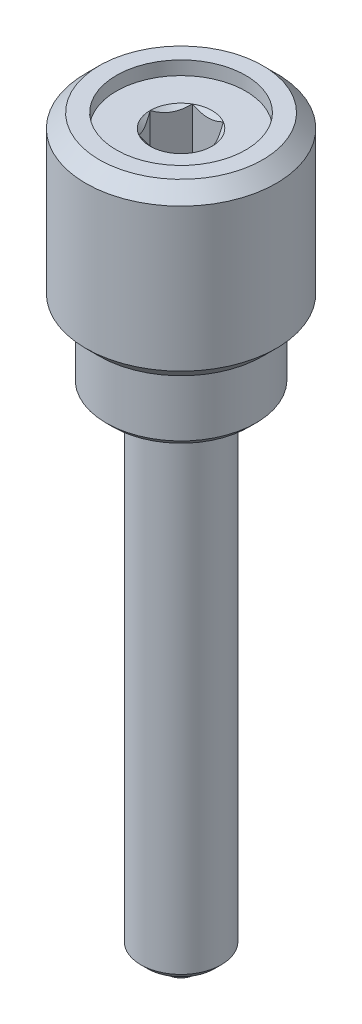
ISO-10303-21;
HEADER;
FILE_DESCRIPTION(('STEP AP214'),'2;1');
FILE_NAME('part.step','',(''),(''),'','','');
FILE_SCHEMA(('AUTOMOTIVE_DESIGN { 1 0 10303 214 1 1 1 1 }'));
ENDSEC;
DATA;
#1=APPLICATION_CONTEXT('core data for automotive mechanical design processes');
#2=APPLICATION_PROTOCOL_DEFINITION('international standard','automotive_design',2000,#1);
#3=PRODUCT_CONTEXT('',#1,'mechanical');
#4=PRODUCT('Part','Part','',(#3));
#5=PRODUCT_RELATED_PRODUCT_CATEGORY('part','',(#4));
#6=PRODUCT_DEFINITION_FORMATION('','',#4);
#7=PRODUCT_DEFINITION_CONTEXT('part definition',#1,'design');
#8=PRODUCT_DEFINITION('design','',#6,#7);
#9=PRODUCT_DEFINITION_SHAPE('','',#8);
#10=(LENGTH_UNIT() NAMED_UNIT(*) SI_UNIT(.MILLI.,.METRE.));
#11=(NAMED_UNIT(*) PLANE_ANGLE_UNIT() SI_UNIT($,.RADIAN.));
#12=(NAMED_UNIT(*) SI_UNIT($,.STERADIAN.) SOLID_ANGLE_UNIT());
#13=UNCERTAINTY_MEASURE_WITH_UNIT(LENGTH_MEASURE(1.E-05),#10,'distance_accuracy_value','');
#14=(GEOMETRIC_REPRESENTATION_CONTEXT(3) GLOBAL_UNCERTAINTY_ASSIGNED_CONTEXT((#13)) GLOBAL_UNIT_ASSIGNED_CONTEXT((#10,
#11,#12)) REPRESENTATION_CONTEXT('',''));
#15=CARTESIAN_POINT('',(0.,0.,0.));
#16=DIRECTION('',(0.,0.,1.));
#17=DIRECTION('',(1.,0.,0.));
#18=AXIS2_PLACEMENT_3D('',#15,#16,#17);
#19=CARTESIAN_POINT('',(-32.4595739108986,28.4606144962938,-1.77583706374662));
#20=DIRECTION('',(0.,1.,0.));
#21=DIRECTION('',(-0.634151036933604,0.,0.77320919701982));
#22=AXIS2_PLACEMENT_3D('',#19,#20,#21);
#23=PLANE('',#22);
#24=CARTESIAN_POINT('',(-32.4595739108986,28.4606144962938,-1.77583706374662));
#25=DIRECTION('',(0.,-1.,0.));
#26=DIRECTION('',(0.634151036933604,0.,-0.77320919701982));
#27=AXIS2_PLACEMENT_3D('',#24,#25,#26);
#28=CIRCLE('',#27,1.246);
#29=CARTESIAN_POINT('',(-31.6694217188793,28.4606144962938,-2.73925572323332));
#30=VERTEX_POINT('',#29);
#31=EDGE_CURVE('P0_E11',#30,#30,#28,.T.);
#32=ORIENTED_EDGE('',*,*,#31,.F.);
#33=EDGE_LOOP('',(#32));
#34=FACE_BOUND('',#33,.T.);
#35=ADVANCED_FACE('P0_F17',(#34),#23,.T.);
#36=CARTESIAN_POINT('',(-32.4595739108986,28.2066144962938,-1.77583706374662));
#37=DIRECTION('',(0.,-1.,0.));
#38=DIRECTION('',(0.634151036933604,0.,-0.77320919701982));
#39=AXIS2_PLACEMENT_3D('',#36,#37,#38);
#40=CONICAL_SURFACE('',#39,1.5,0.785398163397446);
#41=ORIENTED_EDGE('',*,*,#31,.T.);
#42=EDGE_LOOP('',(#41));
#43=FACE_BOUND('',#42,.T.);
#44=CARTESIAN_POINT('',(-32.4595739108986,28.2066144962938,-1.77583706374662));
#45=DIRECTION('',(0.,-1.,0.));
#46=DIRECTION('',(0.634151036933604,0.,-0.77320919701982));
#47=AXIS2_PLACEMENT_3D('',#44,#45,#46);
#48=CIRCLE('',#47,1.5);
#49=CARTESIAN_POINT('',(-31.5083473554982,28.2066144962938,-2.93565085927635));
#50=VERTEX_POINT('',#49);
#51=EDGE_CURVE('P0_E23',#50,#50,#48,.T.);
#52=ORIENTED_EDGE('',*,*,#51,.F.);
#53=EDGE_LOOP('',(#52));
#54=FACE_BOUND('',#53,.T.);
#55=ADVANCED_FACE('P0_F40',(#43,#54),#40,.T.);
#56=CARTESIAN_POINT('',(-32.4595739108986,6.39222676754855,-1.77583706374662));
#57=DIRECTION('',(0.,-1.,0.));
#58=DIRECTION('',(0.634151036933604,0.,-0.77320919701982));
#59=AXIS2_PLACEMENT_3D('',#56,#57,#58);
#60=CYLINDRICAL_SURFACE('',#59,1.5);
#61=ORIENTED_EDGE('',*,*,#51,.T.);
#62=EDGE_LOOP('',(#61));
#63=FACE_BOUND('',#62,.T.);
#64=CARTESIAN_POINT('',(-32.4595739108986,5.47661449629384,-1.77583706374662));
#65=DIRECTION('',(0.,-1.,0.));
#66=DIRECTION('',(0.634151036933604,0.,-0.77320919701982));
#67=AXIS2_PLACEMENT_3D('',#64,#65,#66);
#68=CIRCLE('',#67,1.5);
#69=CARTESIAN_POINT('',(-31.5083473554982,5.47661449629384,-2.93565085927635));
#70=VERTEX_POINT('',#69);
#71=EDGE_CURVE('P0_E52',#70,#70,#68,.T.);
#72=ORIENTED_EDGE('',*,*,#71,.F.);
#73=EDGE_LOOP('',(#72));
#74=FACE_BOUND('',#73,.T.);
#75=ADVANCED_FACE('P0_F45',(#63,#74),#60,.T.);
#76=CARTESIAN_POINT('',(-32.4595739108986,5.22261449629384,-1.77583706374662));
#77=DIRECTION('',(0.,1.,0.));
#78=DIRECTION('',(-0.634151036933604,0.,0.77320919701982));
#79=AXIS2_PLACEMENT_3D('',#76,#77,#78);
#80=CONICAL_SURFACE('',#79,1.246,0.785398163397447);
#81=ORIENTED_EDGE('',*,*,#71,.T.);
#82=EDGE_LOOP('',(#81));
#83=FACE_BOUND('',#82,.T.);
#84=CARTESIAN_POINT('',(-32.4595739108986,5.22261449629384,-1.77583706374662));
#85=DIRECTION('',(0.,-1.,0.));
#86=DIRECTION('',(0.634151036933604,0.,-0.77320919701982));
#87=AXIS2_PLACEMENT_3D('',#84,#85,#86);
#88=CIRCLE('',#87,1.246);
#89=CARTESIAN_POINT('',(-31.6694217188793,5.22261449629384,-2.73925572323332));
#90=VERTEX_POINT('',#89);
#91=EDGE_CURVE('P0_E54',#90,#90,#88,.T.);
#92=ORIENTED_EDGE('',*,*,#91,.F.);
#93=EDGE_LOOP('',(#92));
#94=FACE_BOUND('',#93,.T.);
#95=ADVANCED_FACE('P0_F68',(#83,#94),#80,.T.);
#96=CARTESIAN_POINT('',(-31.952189666248,5.22261449629384,-2.39448174228218));
#97=DIRECTION('',(0.,-1.,0.));
#98=DIRECTION('',(0.634151036933604,0.,-0.77320919701982));
#99=AXIS2_PLACEMENT_3D('',#96,#97,#98);
#100=PLANE('',#99);
#101=ORIENTED_EDGE('',*,*,#91,.T.);
#102=EDGE_LOOP('',(#101));
#103=FACE_BOUND('',#102,.T.);
#104=CARTESIAN_POINT('',(-32.4595739108986,5.22261449629384,-1.77583706374662));
#105=DIRECTION('',(0.,-1.,0.));
#106=DIRECTION('',(0.634151036933604,0.,-0.77320919701982));
#107=AXIS2_PLACEMENT_3D('',#104,#105,#106);
#108=CIRCLE('',#107,0.8001);
#109=CARTESIAN_POINT('',(-31.952189666248,5.22261449629384,-2.39448174228218));
#110=VERTEX_POINT('',#109);
#111=EDGE_CURVE('P0_E59',#110,#110,#108,.T.);
#112=ORIENTED_EDGE('',*,*,#111,.F.);
#113=EDGE_LOOP('',(#112));
#114=FACE_BOUND('',#113,.T.);
#115=ADVANCED_FACE('P0_F35',(#103,#114),#100,.T.);
#116=CARTESIAN_POINT('',(-32.4595739108986,6.39222676754855,-1.77583706374662));
#117=DIRECTION('',(0.,-1.,0.));
#118=DIRECTION('',(0.634151036933604,0.,-0.77320919701982));
#119=AXIS2_PLACEMENT_3D('',#116,#117,#118);
#120=CYLINDRICAL_SURFACE('',#119,0.8001);
#121=ORIENTED_EDGE('',*,*,#111,.T.);
#122=EDGE_LOOP('',(#121));
#123=FACE_BOUND('',#122,.T.);
#124=CARTESIAN_POINT('',(-32.4595739108986,5.59212676754855,-1.77583706374662));
#125=DIRECTION('',(0.,-1.,0.));
#126=DIRECTION('',(0.634151036933604,0.,-0.77320919701982));
#127=AXIS2_PLACEMENT_3D('',#124,#125,#126);
#128=CIRCLE('',#127,0.8001);
#129=CARTESIAN_POINT('',(-31.952189666248,5.59212676754855,-2.39448174228218));
#130=VERTEX_POINT('',#129);
#131=EDGE_CURVE('P0_E62',#130,#130,#128,.T.);
#132=ORIENTED_EDGE('',*,*,#131,.F.);
#133=EDGE_LOOP('',(#132));
#134=FACE_BOUND('',#133,.T.);
#135=ADVANCED_FACE('P0_F28',(#123,#134),#120,.F.);
#136=CARTESIAN_POINT('',(-32.4595739108986,6.39222676754855,-1.77583706374662));
#137=DIRECTION('',(0.,-1.,0.));
#138=DIRECTION('',(0.634151036933604,0.,-0.77320919701982));
#139=AXIS2_PLACEMENT_3D('',#136,#137,#138);
#140=CONICAL_SURFACE('',#139,0.,0.785398163397448);
#141=ORIENTED_EDGE('',*,*,#131,.T.);
#142=EDGE_LOOP('',(#141));
#143=FACE_BOUND('',#142,.T.);
#144=CARTESIAN_POINT('',(-32.4595739108986,6.39222676754855,-1.77583706374662));
#145=VERTEX_POINT('',#144);
#146=VERTEX_LOOP('',#145);
#147=FACE_BOUND('',#146,.T.);
#148=ADVANCED_FACE('P0_F26',(#143,#147),#140,.F.);
#149=CLOSED_SHELL('',(#35,#55,#75,#95,#115,#135,#148));
#150=MANIFOLD_SOLID_BREP('P0_B1',#149);
#151=CARTESIAN_POINT('',(-38.2704597873602,31.7626144962938,-1.77583706374662));
#152=DIRECTION('',(0.,1.,0.));
#153=DIRECTION('',(0.,0.,1.));
#154=AXIS2_PLACEMENT_3D('',#151,#152,#153);
#155=PLANE('',#154);
#156=CARTESIAN_POINT('',(-32.4595739108986,31.7626144962938,-1.77583706374662));
#157=DIRECTION('',(0.,1.,0.));
#158=DIRECTION('',(0.,0.,1.));
#159=AXIS2_PLACEMENT_3D('',#156,#157,#158);
#160=CIRCLE('',#159,2.413);
#161=CARTESIAN_POINT('',(-32.4595739108986,31.7626144962938,0.637162936253378));
#162=VERTEX_POINT('',#161);
#163=EDGE_CURVE('P1_E29',#162,#162,#160,.T.);
#164=ORIENTED_EDGE('',*,*,#163,.T.);
#165=EDGE_LOOP('',(#164));
#166=FACE_BOUND('',#165,.T.);
#167=CARTESIAN_POINT('',(-32.4595739108986,31.7626144962938,-1.77583706374662));
#168=DIRECTION('',(0.,1.,0.));
#169=DIRECTION('',(-1.,0.,0.));
#170=AXIS2_PLACEMENT_3D('',#167,#168,#169);
#171=CIRCLE('',#170,1.15470053837925);
#172=CARTESIAN_POINT('',(-33.0369241800882,31.7626144962938,-0.77583706374662));
#173=VERTEX_POINT('',#172);
#174=CARTESIAN_POINT('',(-31.882223641709,31.7626144962938,-0.77583706374662));
#175=VERTEX_POINT('',#174);
#176=EDGE_CURVE('P1_E42',#173,#175,#171,.T.);
#177=ORIENTED_EDGE('',*,*,#176,.F.);
#178=CARTESIAN_POINT('',(-33.6142744492779,31.7626144962938,-1.77583706374662));
#179=VERTEX_POINT('',#178);
#180=EDGE_CURVE('P1_E110',#179,#173,#171,.T.);
#181=ORIENTED_EDGE('',*,*,#180,.F.);
#182=CARTESIAN_POINT('',(-33.0369241800882,31.7626144962938,-2.77583706374662));
#183=VERTEX_POINT('',#182);
#184=EDGE_CURVE('P1_E109',#183,#179,#171,.T.);
#185=ORIENTED_EDGE('',*,*,#184,.F.);
#186=CARTESIAN_POINT('',(-31.882223641709,31.7626144962938,-2.77583706374662));
#187=VERTEX_POINT('',#186);
#188=EDGE_CURVE('P1_E81',#187,#183,#171,.T.);
#189=ORIENTED_EDGE('',*,*,#188,.F.);
#190=CARTESIAN_POINT('',(-31.3048733725193,31.7626144962938,-1.77583706374662));
#191=VERTEX_POINT('',#190);
#192=EDGE_CURVE('P1_E74',#191,#187,#171,.T.);
#193=ORIENTED_EDGE('',*,*,#192,.F.);
#194=EDGE_CURVE('P1_E35',#175,#191,#171,.T.);
#195=ORIENTED_EDGE('',*,*,#194,.F.);
#196=EDGE_LOOP('',(#177,#181,#185,#189,#193,#195));
#197=FACE_BOUND('',#196,.T.);
#198=ADVANCED_FACE('P1_F17',(#166,#197),#155,.T.);
#199=CARTESIAN_POINT('',(-32.4595739108986,32.2706144962938,-1.77583706374662));
#200=DIRECTION('',(0.,1.,0.));
#201=DIRECTION('',(0.,0.,1.));
#202=AXIS2_PLACEMENT_3D('',#199,#200,#201);
#203=CYLINDRICAL_SURFACE('',#202,2.413);
#204=CARTESIAN_POINT('',(-32.4595739108986,32.2706144962938,-1.77583706374662));
#205=DIRECTION('',(0.,1.,0.));
#206=DIRECTION('',(0.,0.,1.));
#207=AXIS2_PLACEMENT_3D('',#204,#205,#206);
#208=CIRCLE('',#207,2.413);
#209=CARTESIAN_POINT('',(-32.4595739108986,32.2706144962938,0.637162936253378));
#210=VERTEX_POINT('',#209);
#211=EDGE_CURVE('P1_E181',#210,#210,#208,.T.);
#212=ORIENTED_EDGE('',*,*,#211,.T.);
#213=EDGE_LOOP('',(#212));
#214=FACE_BOUND('',#213,.T.);
#215=ORIENTED_EDGE('',*,*,#163,.F.);
#216=EDGE_LOOP('',(#215));
#217=FACE_BOUND('',#216,.T.);
#218=ADVANCED_FACE('P1_F171',(#214,#217),#203,.F.);
#219=CARTESIAN_POINT('',(-38.2704597873602,32.2706144962938,-1.77583706374662));
#220=DIRECTION('',(0.,1.,0.));
#221=DIRECTION('',(0.,0.,1.));
#222=AXIS2_PLACEMENT_3D('',#219,#220,#221);
#223=PLANE('',#222);
#224=CARTESIAN_POINT('',(-32.4595739108986,32.2706144962938,-1.77583706374662));
#225=DIRECTION('',(0.,1.,0.));
#226=DIRECTION('',(0.,0.,1.));
#227=AXIS2_PLACEMENT_3D('',#224,#225,#226);
#228=CIRCLE('',#227,3.048);
#229=CARTESIAN_POINT('',(-32.4595739108986,32.2706144962938,1.27216293625338));
#230=VERTEX_POINT('',#229);
#231=EDGE_CURVE('P1_E183',#230,#230,#228,.T.);
#232=ORIENTED_EDGE('',*,*,#231,.T.);
#233=EDGE_LOOP('',(#232));
#234=FACE_BOUND('',#233,.T.);
#235=ORIENTED_EDGE('',*,*,#211,.F.);
#236=EDGE_LOOP('',(#235));
#237=FACE_BOUND('',#236,.T.);
#238=ADVANCED_FACE('P1_F176',(#234,#237),#223,.T.);
#239=CARTESIAN_POINT('',(-32.4595739108986,32.2706144962938,-1.77583706374662));
#240=DIRECTION('',(0.,-1.,0.));
#241=DIRECTION('',(0.,0.,-1.));
#242=AXIS2_PLACEMENT_3D('',#239,#240,#241);
#243=CONICAL_SURFACE('',#242,3.048,0.78539816339745);
#244=CARTESIAN_POINT('',(-32.4595739108986,31.7626144962938,-1.77583706374662));
#245=DIRECTION('',(0.,1.,0.));
#246=DIRECTION('',(0.,0.,1.));
#247=AXIS2_PLACEMENT_3D('',#244,#245,#246);
#248=CIRCLE('',#247,3.556);
#249=CARTESIAN_POINT('',(-32.4595739108986,31.7626144962938,1.78016293625338));
#250=VERTEX_POINT('',#249);
#251=EDGE_CURVE('P1_E188',#250,#250,#248,.T.);
#252=ORIENTED_EDGE('',*,*,#251,.T.);
#253=EDGE_LOOP('',(#252));
#254=FACE_BOUND('',#253,.T.);
#255=ORIENTED_EDGE('',*,*,#231,.F.);
#256=EDGE_LOOP('',(#255));
#257=FACE_BOUND('',#256,.T.);
#258=ADVANCED_FACE('P1_F297',(#254,#257),#243,.T.);
#259=CARTESIAN_POINT('',(-32.4595739108986,32.2706144962938,-1.77583706374662));
#260=DIRECTION('',(0.,1.,0.));
#261=DIRECTION('',(0.,0.,1.));
#262=AXIS2_PLACEMENT_3D('',#259,#260,#261);
#263=CYLINDRICAL_SURFACE('',#262,3.556);
#264=CARTESIAN_POINT('',(-32.4595739108986,26.4286144962938,-1.77583706374662));
#265=DIRECTION('',(0.,1.,0.));
#266=DIRECTION('',(0.,0.,1.));
#267=AXIS2_PLACEMENT_3D('',#264,#265,#266);
#268=CIRCLE('',#267,3.556);
#269=CARTESIAN_POINT('',(-32.4595739108986,26.4286144962938,1.78016293625338));
#270=VERTEX_POINT('',#269);
#271=EDGE_CURVE('P1_E191',#270,#270,#268,.T.);
#272=ORIENTED_EDGE('',*,*,#271,.T.);
#273=EDGE_LOOP('',(#272));
#274=FACE_BOUND('',#273,.T.);
#275=ORIENTED_EDGE('',*,*,#251,.F.);
#276=EDGE_LOOP('',(#275));
#277=FACE_BOUND('',#276,.T.);
#278=ADVANCED_FACE('P1_F293',(#274,#277),#263,.T.);
#279=CARTESIAN_POINT('',(-32.4595739108986,26.4286144962938,-1.77583706374662));
#280=DIRECTION('',(0.,1.,0.));
#281=DIRECTION('',(0.,0.,1.));
#282=AXIS2_PLACEMENT_3D('',#279,#280,#281);
#283=CONICAL_SURFACE('',#282,3.556,0.78539816339745);
#284=CARTESIAN_POINT('',(-32.4595739108986,25.9206144962938,-1.77583706374662));
#285=DIRECTION('',(0.,1.,0.));
#286=DIRECTION('',(0.,0.,1.));
#287=AXIS2_PLACEMENT_3D('',#284,#285,#286);
#288=CIRCLE('',#287,3.048);
#289=CARTESIAN_POINT('',(-32.4595739108986,25.9206144962938,1.27216293625338));
#290=VERTEX_POINT('',#289);
#291=EDGE_CURVE('P1_E194',#290,#290,#288,.T.);
#292=ORIENTED_EDGE('',*,*,#291,.T.);
#293=EDGE_LOOP('',(#292));
#294=FACE_BOUND('',#293,.T.);
#295=ORIENTED_EDGE('',*,*,#271,.F.);
#296=EDGE_LOOP('',(#295));
#297=FACE_BOUND('',#296,.T.);
#298=ADVANCED_FACE('P1_F289',(#294,#297),#283,.T.);
#299=CARTESIAN_POINT('',(-38.2704597873602,25.9206144962938,-1.77583706374662));
#300=DIRECTION('',(0.,-1.,0.));
#301=DIRECTION('',(0.,0.,-1.));
#302=AXIS2_PLACEMENT_3D('',#299,#300,#301);
#303=PLANE('',#302);
#304=CARTESIAN_POINT('',(-32.4595739108986,25.9206144962938,-1.77583706374662));
#305=DIRECTION('',(0.,1.,0.));
#306=DIRECTION('',(0.,0.,1.));
#307=AXIS2_PLACEMENT_3D('',#304,#305,#306);
#308=CIRCLE('',#307,2.794);
#309=CARTESIAN_POINT('',(-32.4595739108986,25.9206144962938,1.01816293625338));
#310=VERTEX_POINT('',#309);
#311=EDGE_CURVE('P1_E197',#310,#310,#308,.T.);
#312=ORIENTED_EDGE('',*,*,#311,.T.);
#313=EDGE_LOOP('',(#312));
#314=FACE_BOUND('',#313,.T.);
#315=ORIENTED_EDGE('',*,*,#291,.F.);
#316=EDGE_LOOP('',(#315));
#317=FACE_BOUND('',#316,.T.);
#318=ADVANCED_FACE('P1_F285',(#314,#317),#303,.T.);
#319=CARTESIAN_POINT('',(-32.4595739108986,32.2706144962938,-1.77583706374662));
#320=DIRECTION('',(0.,1.,0.));
#321=DIRECTION('',(0.,0.,1.));
#322=AXIS2_PLACEMENT_3D('',#319,#320,#321);
#323=CYLINDRICAL_SURFACE('',#322,2.794);
#324=CARTESIAN_POINT('',(-32.4595739108986,23.6346144962938,-1.77583706374662));
#325=DIRECTION('',(0.,1.,0.));
#326=DIRECTION('',(0.,0.,1.));
#327=AXIS2_PLACEMENT_3D('',#324,#325,#326);
#328=CIRCLE('',#327,2.794);
#329=CARTESIAN_POINT('',(-32.4595739108986,23.6346144962938,1.01816293625338));
#330=VERTEX_POINT('',#329);
#331=EDGE_CURVE('P1_E200',#330,#330,#328,.T.);
#332=ORIENTED_EDGE('',*,*,#331,.T.);
#333=EDGE_LOOP('',(#332));
#334=FACE_BOUND('',#333,.T.);
#335=ORIENTED_EDGE('',*,*,#311,.F.);
#336=EDGE_LOOP('',(#335));
#337=FACE_BOUND('',#336,.T.);
#338=ADVANCED_FACE('P1_F281',(#334,#337),#323,.T.);
#339=CARTESIAN_POINT('',(-32.4595739108986,23.6346144962938,-1.77583706374662));
#340=DIRECTION('',(0.,1.,0.));
#341=DIRECTION('',(0.,0.,1.));
#342=AXIS2_PLACEMENT_3D('',#339,#340,#341);
#343=CONICAL_SURFACE('',#342,2.794,0.785398163397447);
#344=CARTESIAN_POINT('',(-32.4595739108986,23.3806144962938,-1.77583706374662));
#345=DIRECTION('',(0.,1.,0.));
#346=DIRECTION('',(0.,0.,1.));
#347=AXIS2_PLACEMENT_3D('',#344,#345,#346);
#348=CIRCLE('',#347,2.54);
#349=CARTESIAN_POINT('',(-32.4595739108986,23.3806144962938,0.76416293625338));
#350=VERTEX_POINT('',#349);
#351=EDGE_CURVE('P1_E203',#350,#350,#348,.T.);
#352=ORIENTED_EDGE('',*,*,#351,.T.);
#353=EDGE_LOOP('',(#352));
#354=FACE_BOUND('',#353,.T.);
#355=ORIENTED_EDGE('',*,*,#331,.F.);
#356=EDGE_LOOP('',(#355));
#357=FACE_BOUND('',#356,.T.);
#358=ADVANCED_FACE('P1_F277',(#354,#357),#343,.T.);
#359=CARTESIAN_POINT('',(-38.2704597873602,23.3806144962938,-1.77583706374662));
#360=DIRECTION('',(0.,-1.,0.));
#361=DIRECTION('',(0.,0.,-1.));
#362=AXIS2_PLACEMENT_3D('',#359,#360,#361);
#363=PLANE('',#362);
#364=CARTESIAN_POINT('',(-32.4595739108986,23.3806144962938,-1.77583706374662));
#365=DIRECTION('',(0.,1.,0.));
#366=DIRECTION('',(0.,0.,1.));
#367=AXIS2_PLACEMENT_3D('',#364,#365,#366);
#368=CIRCLE('',#367,1.754);
#369=CARTESIAN_POINT('',(-32.4595739108986,23.3806144962938,-0.0218370637466213));
#370=VERTEX_POINT('',#369);
#371=EDGE_CURVE('P1_E206',#370,#370,#368,.T.);
#372=ORIENTED_EDGE('',*,*,#371,.T.);
#373=EDGE_LOOP('',(#372));
#374=FACE_BOUND('',#373,.T.);
#375=ORIENTED_EDGE('',*,*,#351,.F.);
#376=EDGE_LOOP('',(#375));
#377=FACE_BOUND('',#376,.T.);
#378=ADVANCED_FACE('P1_F273',(#374,#377),#363,.T.);
#379=CARTESIAN_POINT('',(-32.4595739108986,23.3806144962938,-1.77583706374662));
#380=DIRECTION('',(0.,-1.,0.));
#381=DIRECTION('',(0.,0.,-1.));
#382=AXIS2_PLACEMENT_3D('',#379,#380,#381);
#383=CONICAL_SURFACE('',#382,1.754,0.785398163397448);
#384=CARTESIAN_POINT('',(-32.4595739108986,23.6346144962938,-1.77583706374662));
#385=DIRECTION('',(0.,1.,0.));
#386=DIRECTION('',(0.,0.,1.));
#387=AXIS2_PLACEMENT_3D('',#384,#385,#386);
#388=CIRCLE('',#387,1.5);
#389=CARTESIAN_POINT('',(-32.4595739108986,23.6346144962938,-0.27583706374662));
#390=VERTEX_POINT('',#389);
#391=EDGE_CURVE('P1_E209',#390,#390,#388,.T.);
#392=ORIENTED_EDGE('',*,*,#391,.T.);
#393=EDGE_LOOP('',(#392));
#394=FACE_BOUND('',#393,.T.);
#395=ORIENTED_EDGE('',*,*,#371,.F.);
#396=EDGE_LOOP('',(#395));
#397=FACE_BOUND('',#396,.T.);
#398=ADVANCED_FACE('P1_F265',(#394,#397),#383,.F.);
#399=CARTESIAN_POINT('',(-32.4595739108986,32.2706144962938,-1.77583706374662));
#400=DIRECTION('',(0.,1.,0.));
#401=DIRECTION('',(0.,0.,1.));
#402=AXIS2_PLACEMENT_3D('',#399,#400,#401);
#403=CYLINDRICAL_SURFACE('',#402,1.5);
#404=ORIENTED_EDGE('',*,*,#391,.F.);
#405=EDGE_LOOP('',(#404));
#406=FACE_BOUND('',#405,.T.);
#407=CARTESIAN_POINT('',(-32.4595739108986,28.4606144962938,-1.77583706374662));
#408=DIRECTION('',(0.,1.,0.));
#409=DIRECTION('',(0.,0.,1.));
#410=AXIS2_PLACEMENT_3D('',#407,#408,#409);
#411=CIRCLE('',#410,1.5);
#412=CARTESIAN_POINT('',(-32.4595739108986,28.4606144962938,-0.275837063746621));
#413=VERTEX_POINT('',#412);
#414=EDGE_CURVE('P1_E212',#413,#413,#411,.T.);
#415=ORIENTED_EDGE('',*,*,#414,.T.);
#416=EDGE_LOOP('',(#415));
#417=FACE_BOUND('',#416,.T.);
#418=ADVANCED_FACE('P1_F258',(#406,#417),#403,.F.);
#419=CARTESIAN_POINT('',(-38.2704597873602,28.4606144962938,-1.77583706374662));
#420=DIRECTION('',(0.,1.,0.));
#421=DIRECTION('',(0.,0.,1.));
#422=AXIS2_PLACEMENT_3D('',#419,#420,#421);
#423=PLANE('',#422);
#424=ORIENTED_EDGE('',*,*,#414,.F.);
#425=EDGE_LOOP('',(#424));
#426=FACE_BOUND('',#425,.T.);
#427=ADVANCED_FACE('P1_F254',(#426),#423,.F.);
#428=CARTESIAN_POINT('',(-32.4595739108986,31.5086144962938,-1.77583706374662));
#429=DIRECTION('',(0.,1.,0.));
#430=DIRECTION('',(-1.,0.,0.));
#431=AXIS2_PLACEMENT_3D('',#428,#429,#430);
#432=CONICAL_SURFACE('',#431,0.900700538379251,0.785398163397448);
#433=CARTESIAN_POINT('',(-33.6247422733836,32.1433674130659,-2.77583706374662));
#434=CARTESIAN_POINT('',(-33.596432090849,32.1218876781477,-2.77583706374662));
#435=CARTESIAN_POINT('',(-33.5679656646391,32.1006144701731,-2.77583706374662));
#436=CARTESIAN_POINT('',(-33.5106564341386,32.0585668310645,-2.77583706374662));
#437=CARTESIAN_POINT('',(-33.4818135392021,32.0377925236074,-2.77583706374662));
#438=CARTESIAN_POINT('',(-33.3942019417647,31.9760499137238,-2.77583706374662));
#439=CARTESIAN_POINT('',(-33.3347805330449,31.9359925350625,-2.77583706374662));
#440=CARTESIAN_POINT('',(-33.2100870183719,31.8572285908624,-2.77583706374662));
#441=CARTESIAN_POINT('',(-33.1446761947256,31.8187391843815,-2.77583706374662));
#442=CARTESIAN_POINT('',(-33.0105701244641,31.7482457742727,-2.77583706374662));
#443=CARTESIAN_POINT('',(-32.9418869657571,31.7162198905979,-2.77583706374662));
#444=CARTESIAN_POINT('',(-32.838923386553,31.6770351412013,-2.77583706374662));
#445=CARTESIAN_POINT('',(-32.8061964626352,31.6658120993766,-2.77583706374662));
#446=CARTESIAN_POINT('',(-32.7399405477758,31.6459918281835,-2.77583706374662));
#447=CARTESIAN_POINT('',(-32.7064115028952,31.6373947759391,-2.77583706374662));
#448=CARTESIAN_POINT('',(-32.6393239588747,31.6234213023739,-2.77583706374662));
#449=CARTESIAN_POINT('',(-32.6057774135426,31.6179883937335,-2.77583706374662));
#450=CARTESIAN_POINT('',(-32.5382995218515,31.6104480549176,-2.77583706374662));
#451=CARTESIAN_POINT('',(-32.5043681211542,31.608341100376,-2.77583706374662));
#452=CARTESIAN_POINT('',(-32.437759831964,31.6076184235041,-2.77583706374662));
#453=CARTESIAN_POINT('',(-32.4050843121572,31.6088729682008,-2.77583706374662));
#454=CARTESIAN_POINT('',(-32.3400174637006,31.6145136706225,-2.77583706374662));
#455=CARTESIAN_POINT('',(-32.3076260705077,31.618899097443,-2.77583706374662));
#456=CARTESIAN_POINT('',(-32.2427969796693,31.6306342043921,-2.77583706374662));
#457=CARTESIAN_POINT('',(-32.2103687293666,31.6380352807498,-2.77583706374662));
#458=CARTESIAN_POINT('',(-32.1462225784046,31.6554042038815,-2.77583706374662));
#459=CARTESIAN_POINT('',(-32.1145046233078,31.6653718532149,-2.77583706374662));
#460=CARTESIAN_POINT('',(-32.0152607936023,31.7003263963559,-2.77583706374662));
#461=CARTESIAN_POINT('',(-31.9491315681529,31.7292684709499,-2.77583706374662));
#462=CARTESIAN_POINT('',(-31.8199743281985,31.7936347215138,-2.77583706374662));
#463=CARTESIAN_POINT('',(-31.7569584514134,31.8290820618113,-2.77583706374662));
#464=CARTESIAN_POINT('',(-31.6365173803214,31.902231509739,-2.77583706374662));
#465=CARTESIAN_POINT('',(-31.5789698951128,31.9397347692562,-2.77583706374662));
#466=CARTESIAN_POINT('',(-31.4941855076805,31.9977188686421,-2.77583706374662));
#467=CARTESIAN_POINT('',(-31.466289636527,32.0172528929957,-2.77583706374662));
#468=CARTESIAN_POINT('',(-31.4108795288986,32.056839676686,-2.77583706374662));
#469=CARTESIAN_POINT('',(-31.383365190058,32.0768922925786,-2.77583706374662));
#470=CARTESIAN_POINT('',(-31.3560097914198,32.0971599972919,-2.77583706374662));
#471=B_SPLINE_CURVE_WITH_KNOTS('',3,(#433,#434,#435,#436,#437,#438,#439,#440,#441,#442,#443,
#444,#445,#446,#447,#448,#449,#450,#451,#452,#453,#454,#455,#456,#457,#458,#459,#460,#461,#462,
#463,#464,#465,#466,#467,#468,#469,#470),.UNSPECIFIED.,.F.,.F.,(4,2,2,2,2,2,2,2,2,2,2,2,2,2,2,2,
2,2,4),(0.,0.106606940896332,0.213240042246473,0.428132991376091,0.655634512005481,
0.88235248640155,0.986058447883146,1.08977140282762,1.19157109890217,1.29338535170645,
1.39132734377512,1.48924647876187,1.58890934146288,1.68856453961813,1.90448646818009,
2.12119273268527,2.32715767052322,2.42931938152474,2.53145313028663),.UNSPECIFIED.);
#472=EDGE_CURVE('P1_E11',#183,#187,#471,.T.);
#473=ORIENTED_EDGE('',*,*,#472,.T.);
#474=ORIENTED_EDGE('',*,*,#188,.T.);
#475=EDGE_LOOP('',(#473,#474));
#476=FACE_BOUND('',#475,.T.);
#477=ADVANCED_FACE('P1_F86',(#476),#432,.F.);
#478=CARTESIAN_POINT('',(-33.6143899193317,31.7627299836665,-1.77563706374662));
#479=CARTESIAN_POINT('',(-33.5945391188489,31.7428924271196,-1.8100196587538));
#480=CARTESIAN_POINT('',(-33.574356383458,31.7242195169327,-1.84497718188644));
#481=CARTESIAN_POINT('',(-33.5332013061908,31.690029239017,-1.91625986670271));
#482=CARTESIAN_POINT('',(-33.5122250464794,31.6745309053173,-1.9525918142756));
#483=CARTESIAN_POINT('',(-33.4699272899966,31.6479818034361,-2.02585367754993));
#484=CARTESIAN_POINT('',(-33.4486165770078,31.6368642702908,-2.06276491519204));
#485=CARTESIAN_POINT('',(-33.4055261101813,31.61973436207,-2.13739979305748));
#486=CARTESIAN_POINT('',(-33.3837476735252,31.6137091937605,-2.17512115185526));
#487=CARTESIAN_POINT('',(-33.3462152235386,31.6082750512613,-2.24012926216455));
#488=CARTESIAN_POINT('',(-33.3305100415709,31.6074714346106,-2.26733143527479));
#489=CARTESIAN_POINT('',(-33.2991300907614,31.6088211957107,-2.32168310441573));
#490=CARTESIAN_POINT('',(-33.2834553293935,31.610975225841,-2.3488325875015));
#491=CARTESIAN_POINT('',(-33.236654881498,31.6217314684223,-2.42989334107358));
#492=CARTESIAN_POINT('',(-33.205762102015,31.6346290527092,-2.48340120472505));
#493=CARTESIAN_POINT('',(-33.1515420273182,31.665755226896,-2.57731312889005));
#494=CARTESIAN_POINT('',(-33.127960468192,31.6823522939957,-2.61815758741845));
#495=CARTESIAN_POINT('',(-33.0817209968323,31.7197394209791,-2.69824670112856));
#496=CARTESIAN_POINT('',(-33.0590603604832,31.7405158381112,-2.73749607461706));
#497=CARTESIAN_POINT('',(-33.0368087100344,31.7627299836665,-2.77603706374662));
#498=B_SPLINE_CURVE_WITH_KNOTS('',3,(#478,#479,#480,#481,#482,#483,#484,#485,#486,#487,#488,
#489,#490,#491,#492,#493,#494,#495,#496,#497),.UNSPECIFIED.,.F.,.F.,(4,2,2,2,2,2,2,2,2,4),(0.,
0.133237676828555,0.267252229834489,0.399137076269301,0.530689603280768,0.624814864263849,
0.718960890149131,0.907306626112094,1.05710100361789,1.20641411519286),.UNSPECIFIED.);
#499=EDGE_CURVE('P1_E113',#179,#183,#498,.T.);
#500=ORIENTED_EDGE('',*,*,#499,.T.);
#501=ORIENTED_EDGE('',*,*,#184,.T.);
#502=EDGE_LOOP('',(#500,#501));
#503=FACE_BOUND('',#502,.T.);
#504=ADVANCED_FACE('P1_F247',(#503),#432,.F.);
#505=CARTESIAN_POINT('',(-33.0368087100344,31.7627299836665,-0.77563706374662));
#506=CARTESIAN_POINT('',(-33.0566595105172,31.7428924271196,-0.810019658753802));
#507=CARTESIAN_POINT('',(-33.0768422459081,31.7242195169327,-0.844977181886445));
#508=CARTESIAN_POINT('',(-33.1179973231753,31.690029239017,-0.91625986670271));
#509=CARTESIAN_POINT('',(-33.1389735828867,31.6745309053173,-0.952591814275605));
#510=CARTESIAN_POINT('',(-33.1812713393694,31.6479818034361,-1.02585367754993));
#511=CARTESIAN_POINT('',(-33.2025820523582,31.6368642702908,-1.06276491519204));
#512=CARTESIAN_POINT('',(-33.2456725191848,31.61973436207,-1.13739979305748));
#513=CARTESIAN_POINT('',(-33.2674509558409,31.6137091937605,-1.17512115185526));
#514=CARTESIAN_POINT('',(-33.3049834058275,31.6082750512613,-1.24012926216455));
#515=CARTESIAN_POINT('',(-33.3206885877952,31.6074714346106,-1.26733143527479));
#516=CARTESIAN_POINT('',(-33.3520685386046,31.6088211957107,-1.32168310441573));
#517=CARTESIAN_POINT('',(-33.3677432999726,31.610975225841,-1.3488325875015));
#518=CARTESIAN_POINT('',(-33.4145437478681,31.6217314684223,-1.42989334107358));
#519=CARTESIAN_POINT('',(-33.445436527351,31.6346290527092,-1.48340120472504));
#520=CARTESIAN_POINT('',(-33.4996566020478,31.665755226896,-1.57731312889005));
#521=CARTESIAN_POINT('',(-33.5232381611741,31.6823522939957,-1.61815758741845));
#522=CARTESIAN_POINT('',(-33.5694776325338,31.7197394209791,-1.69824670112856));
#523=CARTESIAN_POINT('',(-33.5921382688829,31.7405158381112,-1.73749607461706));
#524=CARTESIAN_POINT('',(-33.6143899193317,31.7627299836665,-1.77603706374662));
#525=B_SPLINE_CURVE_WITH_KNOTS('',3,(#505,#506,#507,#508,#509,#510,#511,#512,#513,#514,#515,
#516,#517,#518,#519,#520,#521,#522,#523,#524),.UNSPECIFIED.,.F.,.F.,(4,2,2,2,2,2,2,2,2,4),(0.,
0.133237676828556,0.267252229834495,0.399137076269304,0.530689603280768,0.624814864263844,
0.718960890149132,0.907306626112094,1.05710100361789,1.20641411519286),.UNSPECIFIED.);
#526=EDGE_CURVE('P1_E119',#173,#179,#525,.T.);
#527=ORIENTED_EDGE('',*,*,#526,.T.);
#528=ORIENTED_EDGE('',*,*,#180,.T.);
#529=EDGE_LOOP('',(#527,#528));
#530=FACE_BOUND('',#529,.T.);
#531=ADVANCED_FACE('P1_F243',(#530),#432,.F.);
#532=CARTESIAN_POINT('',(-33.624742273449,32.1433674131155,-0.77583706374662));
#533=CARTESIAN_POINT('',(-33.5964320909126,32.1218876781954,-0.77583706374662));
#534=CARTESIAN_POINT('',(-33.5679656647008,32.1006144702188,-0.77583706374662));
#535=CARTESIAN_POINT('',(-33.5106564341965,32.0585668311065,-0.77583706374662));
#536=CARTESIAN_POINT('',(-33.4818135392581,32.0377925236474,-0.77583706374662));
#537=CARTESIAN_POINT('',(-33.394201941815,31.9760499137581,-0.77583706374662));
#538=CARTESIAN_POINT('',(-33.3347805330913,31.935992535093,-0.77583706374662));
#539=CARTESIAN_POINT('',(-33.2100870184099,31.8572285908851,-0.77583706374662));
#540=CARTESIAN_POINT('',(-33.1446761947589,31.8187391844002,-0.77583706374662));
#541=CARTESIAN_POINT('',(-33.0105701244878,31.7482457742839,-0.77583706374662));
#542=CARTESIAN_POINT('',(-32.9418869657758,31.7162198906058,-0.77583706374662));
#543=CARTESIAN_POINT('',(-32.8389233865679,31.6770351412067,-0.77583706374662));
#544=CARTESIAN_POINT('',(-32.8061964626517,31.6658120993821,-0.77583706374662));
#545=CARTESIAN_POINT('',(-32.7399405477955,31.6459918281889,-0.77583706374662));
#546=CARTESIAN_POINT('',(-32.7064115029166,31.6373947759443,-0.77583706374662));
#547=CARTESIAN_POINT('',(-32.6393239588993,31.6234213023783,-0.77583706374662));
#548=CARTESIAN_POINT('',(-32.6057774135688,31.6179883937374,-0.77583706374662));
#549=CARTESIAN_POINT('',(-32.5382995218808,31.6104480549199,-0.77583706374662));
#550=CARTESIAN_POINT('',(-32.504368121185,31.6083411003774,-0.77583706374662));
#551=CARTESIAN_POINT('',(-32.4377598319976,31.6076184235034,-0.77583706374662));
#552=CARTESIAN_POINT('',(-32.4050843121921,31.608872968199,-0.77583706374662));
#553=CARTESIAN_POINT('',(-32.3400174637379,31.6145136706181,-0.77583706374662));
#554=CARTESIAN_POINT('',(-32.3076260705461,31.6188990974373,-0.77583706374662));
#555=CARTESIAN_POINT('',(-32.2427969797099,31.6306342043835,-0.77583706374662));
#556=CARTESIAN_POINT('',(-32.2103687294082,31.6380352807397,-0.77583706374662));
#557=CARTESIAN_POINT('',(-32.1462225784483,31.6554042038684,-0.77583706374662));
#558=CARTESIAN_POINT('',(-32.1145046233526,31.6653718532003,-0.775837063746621));
#559=CARTESIAN_POINT('',(-32.0152607936567,31.7003263963342,-0.775837063746621));
#560=CARTESIAN_POINT('',(-31.9491315682155,31.7292684709216,-0.775837063746621));
#561=CARTESIAN_POINT('',(-31.8199743282769,31.7936347214718,-0.775837063746621));
#562=CARTESIAN_POINT('',(-31.7569584514994,31.8290820617619,-0.775837063746621));
#563=CARTESIAN_POINT('',(-31.636517380421,31.9022315096758,-0.775837063746621));
#564=CARTESIAN_POINT('',(-31.5789698952185,31.9397347691864,-0.775837063746621));
#565=CARTESIAN_POINT('',(-31.4941855077952,31.9977188685625,-0.775837063746621));
#566=CARTESIAN_POINT('',(-31.4662896366446,32.0172528929128,-0.775837063746621));
#567=CARTESIAN_POINT('',(-31.4108795290221,32.0568396765966,-0.775837063746621));
#568=CARTESIAN_POINT('',(-31.3833651901845,32.076892292486,-0.775837063746621));
#569=CARTESIAN_POINT('',(-31.3560097915492,32.097159997196,-0.775837063746621));
#570=B_SPLINE_CURVE_WITH_KNOTS('',3,(#532,#533,#534,#535,#536,#537,#538,#539,#540,#541,#542,
#543,#544,#545,#546,#547,#548,#549,#550,#551,#552,#553,#554,#555,#556,#557,#558,#559,#560,#561,
#562,#563,#564,#565,#566,#567,#568,#569),.UNSPECIFIED.,.F.,.F.,(4,2,2,2,2,2,2,2,2,2,2,2,2,2,2,2,
2,2,4),(0.,0.10660694090423,0.21324004226227,0.428132991407943,0.655634512055361,
0.882352486469309,0.986058447946298,1.08977140288615,1.19157109895629,1.29338535175614,
1.39132734382096,1.48924647880384,1.58890934150069,1.68856453965177,1.90448646818342,
2.12119273265809,2.32715767046996,2.42931938145862,2.53145313020764),.UNSPECIFIED.);
#571=EDGE_CURVE('P1_E138',#175,#173,#570,.F.);
#572=ORIENTED_EDGE('',*,*,#571,.T.);
#573=ORIENTED_EDGE('',*,*,#176,.T.);
#574=EDGE_LOOP('',(#572,#573));
#575=FACE_BOUND('',#574,.T.);
#576=ADVANCED_FACE('P1_F253',(#575),#432,.F.);
#577=CARTESIAN_POINT('',(-31.3047579024655,31.7627299836664,-1.77603706374662));
#578=CARTESIAN_POINT('',(-31.3246087029483,31.7428924271196,-1.74165446873944));
#579=CARTESIAN_POINT('',(-31.3447914383392,31.7242195169327,-1.7066969456068));
#580=CARTESIAN_POINT('',(-31.3859465156064,31.690029239017,-1.63541426079053));
#581=CARTESIAN_POINT('',(-31.4069227753178,31.6745309053173,-1.59908231321764));
#582=CARTESIAN_POINT('',(-31.4492205318006,31.6479818034361,-1.52582044994331));
#583=CARTESIAN_POINT('',(-31.4705312447894,31.6368642702908,-1.48890921230121));
#584=CARTESIAN_POINT('',(-31.5136217116159,31.61973436207,-1.41427433443576));
#585=CARTESIAN_POINT('',(-31.535400148272,31.6137091937605,-1.37655297563799));
#586=CARTESIAN_POINT('',(-31.5729325982586,31.6082750512613,-1.31154486532869));
#587=CARTESIAN_POINT('',(-31.5886377802263,31.6074714346106,-1.28434269221845));
#588=CARTESIAN_POINT('',(-31.6200177310357,31.6088211957107,-1.22999102307751));
#589=CARTESIAN_POINT('',(-31.6356924924037,31.610975225841,-1.20284153999175));
#590=CARTESIAN_POINT('',(-31.6824929402992,31.6217314684223,-1.12178078641967));
#591=CARTESIAN_POINT('',(-31.7133857197822,31.6346290527092,-1.0682729227682));
#592=CARTESIAN_POINT('',(-31.7676057944789,31.665755226896,-0.974360998603193));
#593=CARTESIAN_POINT('',(-31.7911873536052,31.6823522939957,-0.93351654007479));
#594=CARTESIAN_POINT('',(-31.8374268249649,31.7197394209791,-0.853427426364678));
#595=CARTESIAN_POINT('',(-31.860087461314,31.7405158381112,-0.814178052876183));
#596=CARTESIAN_POINT('',(-31.8823391117628,31.7627299836665,-0.775637063746621));
#597=B_SPLINE_CURVE_WITH_KNOTS('',3,(#577,#578,#579,#580,#581,#582,#583,#584,#585,#586,#587,
#588,#589,#590,#591,#592,#593,#594,#595,#596),.UNSPECIFIED.,.F.,.F.,(4,2,2,2,2,2,2,2,2,4),(0.,
0.133237676828558,0.267252229834488,0.399137076269296,0.530689603280766,0.624814864263841,
0.718960890149127,0.907306626112092,1.05710100361789,1.20641411519286),.UNSPECIFIED.);
#598=EDGE_CURVE('P1_E98',#191,#175,#597,.T.);
#599=ORIENTED_EDGE('',*,*,#598,.T.);
#600=ORIENTED_EDGE('',*,*,#194,.T.);
#601=EDGE_LOOP('',(#599,#600));
#602=FACE_BOUND('',#601,.T.);
#603=ADVANCED_FACE('P1_F131',(#602),#432,.F.);
#604=CARTESIAN_POINT('',(-31.8823391117628,31.7627299836665,-2.77603706374662));
#605=CARTESIAN_POINT('',(-31.86248831128,31.7428924271196,-2.74165446873944));
#606=CARTESIAN_POINT('',(-31.8423055758891,31.7242195169327,-2.7066969456068));
#607=CARTESIAN_POINT('',(-31.8011504986219,31.690029239017,-2.63541426079053));
#608=CARTESIAN_POINT('',(-31.7801742389105,31.6745309053173,-2.59908231321764));
#609=CARTESIAN_POINT('',(-31.7378764824277,31.6479818034361,-2.52582044994331));
#610=CARTESIAN_POINT('',(-31.716565769439,31.6368642702908,-2.4889092123012));
#611=CARTESIAN_POINT('',(-31.6734753026124,31.61973436207,-2.41427433443576));
#612=CARTESIAN_POINT('',(-31.6516968659563,31.6137091937605,-2.37655297563799));
#613=CARTESIAN_POINT('',(-31.6141644159697,31.6082750512613,-2.31154486532869));
#614=CARTESIAN_POINT('',(-31.598459234002,31.6074714346106,-2.28434269221845));
#615=CARTESIAN_POINT('',(-31.5670792831926,31.6088211957107,-2.22999102307751));
#616=CARTESIAN_POINT('',(-31.5514045218246,31.610975225841,-2.20284153999175));
#617=CARTESIAN_POINT('',(-31.5046040739291,31.6217314684223,-2.12178078641966));
#618=CARTESIAN_POINT('',(-31.4737112944462,31.6346290527092,-2.0682729227682));
#619=CARTESIAN_POINT('',(-31.4194912197494,31.665755226896,-1.97436099860319));
#620=CARTESIAN_POINT('',(-31.3959096606231,31.6823522939957,-1.93351654007479));
#621=CARTESIAN_POINT('',(-31.3496701892634,31.7197394209791,-1.85342742636468));
#622=CARTESIAN_POINT('',(-31.3270095529143,31.7405158381112,-1.81417805287618));
#623=CARTESIAN_POINT('',(-31.3047579024655,31.7627299836664,-1.77563706374662));
#624=B_SPLINE_CURVE_WITH_KNOTS('',3,(#604,#605,#606,#607,#608,#609,#610,#611,#612,#613,#614,
#615,#616,#617,#618,#619,#620,#621,#622,#623),.UNSPECIFIED.,.F.,.F.,(4,2,2,2,2,2,2,2,2,4),(0.,
0.133237676828558,0.267252229834494,0.399137076269304,0.530689603280768,0.624814864263844,
0.718960890149132,0.907306626112095,1.05710100361789,1.20641411519286),.UNSPECIFIED.);
#625=EDGE_CURVE('P1_E77',#187,#191,#624,.T.);
#626=ORIENTED_EDGE('',*,*,#625,.T.);
#627=ORIENTED_EDGE('',*,*,#192,.T.);
#628=EDGE_LOOP('',(#626,#627));
#629=FACE_BOUND('',#628,.T.);
#630=ADVANCED_FACE('P1_F75',(#629),#432,.F.);
#631=CARTESIAN_POINT('',(-32.4595739108986,29.2226144962938,-3.77583706374662));
#632=DIRECTION('',(0.,1.,0.));
#633=DIRECTION('',(0.,0.,1.));
#634=AXIS2_PLACEMENT_3D('',#631,#632,#633);
#635=PLANE('',#634);
#636=DIRECTION('',(-0.5,0.,-0.866025403784438));
#637=VECTOR('',#636,1.);
#638=CARTESIAN_POINT('',(-31.3048733725193,29.2226144962938,-1.77583706374662));
#639=LINE('',#638,#637);
#640=CARTESIAN_POINT('',(-31.3048733725193,29.2226144962938,-1.77583706374662));
#641=VERTEX_POINT('',#640);
#642=CARTESIAN_POINT('',(-31.882223641709,29.2226144962938,-2.77583706374662));
#643=VERTEX_POINT('',#642);
#644=EDGE_CURVE('P1_E97',#641,#643,#639,.T.);
#645=ORIENTED_EDGE('',*,*,#644,.T.);
#646=DIRECTION('',(-1.,0.,0.));
#647=VECTOR('',#646,1.);
#648=CARTESIAN_POINT('',(-31.882223641709,29.2226144962938,-2.77583706374662));
#649=LINE('',#648,#647);
#650=CARTESIAN_POINT('',(-33.0369241800882,29.2226144962938,-2.77583706374662));
#651=VERTEX_POINT('',#650);
#652=EDGE_CURVE('P1_E102',#643,#651,#649,.T.);
#653=ORIENTED_EDGE('',*,*,#652,.T.);
#654=DIRECTION('',(-0.5,0.,0.866025403784439));
#655=VECTOR('',#654,1.);
#656=CARTESIAN_POINT('',(-33.0369241800882,29.2226144962938,-2.77583706374662));
#657=LINE('',#656,#655);
#658=CARTESIAN_POINT('',(-33.6142744492779,29.2226144962938,-1.77583706374662));
#659=VERTEX_POINT('',#658);
#660=EDGE_CURVE('P1_E233',#651,#659,#657,.T.);
#661=ORIENTED_EDGE('',*,*,#660,.T.);
#662=DIRECTION('',(0.5,0.,0.866025403784439));
#663=VECTOR('',#662,1.);
#664=CARTESIAN_POINT('',(-33.6142744492779,29.2226144962938,-1.77583706374662));
#665=LINE('',#664,#663);
#666=CARTESIAN_POINT('',(-33.0369241800882,29.2226144962938,-0.77583706374662));
#667=VERTEX_POINT('',#666);
#668=EDGE_CURVE('P1_E230',#659,#667,#665,.T.);
#669=ORIENTED_EDGE('',*,*,#668,.T.);
#670=DIRECTION('',(1.,0.,0.));
#671=VECTOR('',#670,1.);
#672=CARTESIAN_POINT('',(-33.0369241800882,29.2226144962938,-0.77583706374662));
#673=LINE('',#672,#671);
#674=CARTESIAN_POINT('',(-31.882223641709,29.2226144962938,-0.775837063746621));
#675=VERTEX_POINT('',#674);
#676=EDGE_CURVE('P1_E227',#667,#675,#673,.T.);
#677=ORIENTED_EDGE('',*,*,#676,.T.);
#678=DIRECTION('',(0.5,0.,-0.866025403784439));
#679=VECTOR('',#678,1.);
#680=CARTESIAN_POINT('',(-31.882223641709,29.2226144962938,-0.775837063746621));
#681=LINE('',#680,#679);
#682=EDGE_CURVE('P1_E105',#675,#641,#681,.T.);
#683=ORIENTED_EDGE('',*,*,#682,.T.);
#684=EDGE_LOOP('',(#645,#653,#661,#669,#677,#683));
#685=FACE_BOUND('',#684,.T.);
#686=ADVANCED_FACE('P1_F130',(#685),#635,.T.);
#687=CARTESIAN_POINT('',(-31.882223641709,29.2226144962938,-2.77583706374662));
#688=DIRECTION('',(0.,0.,-1.));
#689=DIRECTION('',(-1.,0.,0.));
#690=AXIS2_PLACEMENT_3D('',#687,#688,#689);
#691=PLANE('',#690);
#692=ORIENTED_EDGE('',*,*,#472,.F.);
#693=DIRECTION('',(0.,1.,0.));
#694=VECTOR('',#693,1.);
#695=CARTESIAN_POINT('',(-33.0369241800882,29.2226144962938,-2.77583706374662));
#696=LINE('',#695,#694);
#697=EDGE_CURVE('P1_E104',#651,#183,#696,.T.);
#698=ORIENTED_EDGE('',*,*,#697,.F.);
#699=ORIENTED_EDGE('',*,*,#652,.F.);
#700=DIRECTION('',(0.,1.,0.));
#701=VECTOR('',#700,1.);
#702=CARTESIAN_POINT('',(-31.882223641709,29.2226144962938,-2.77583706374662));
#703=LINE('',#702,#701);
#704=EDGE_CURVE('P1_E94',#643,#187,#703,.T.);
#705=ORIENTED_EDGE('',*,*,#704,.T.);
#706=EDGE_LOOP('',(#692,#698,#699,#705));
#707=FACE_BOUND('',#706,.T.);
#708=ADVANCED_FACE('P1_F100',(#707),#691,.F.);
#709=CARTESIAN_POINT('',(-33.0369241800882,29.2226144962938,-2.77583706374662));
#710=DIRECTION('',(-0.866025403784439,0.,-0.5));
#711=DIRECTION('',(-0.5,0.,0.866025403784439));
#712=AXIS2_PLACEMENT_3D('',#709,#710,#711);
#713=PLANE('',#712);
#714=ORIENTED_EDGE('',*,*,#499,.F.);
#715=DIRECTION('',(0.,1.,0.));
#716=VECTOR('',#715,1.);
#717=CARTESIAN_POINT('',(-33.6142744492779,29.2226144962938,-1.77583706374662));
#718=LINE('',#717,#716);
#719=EDGE_CURVE('P1_E216',#659,#179,#718,.T.);
#720=ORIENTED_EDGE('',*,*,#719,.F.);
#721=ORIENTED_EDGE('',*,*,#660,.F.);
#722=ORIENTED_EDGE('',*,*,#697,.T.);
#723=EDGE_LOOP('',(#714,#720,#721,#722));
#724=FACE_BOUND('',#723,.T.);
#725=ADVANCED_FACE('P1_F125',(#724),#713,.F.);
#726=CARTESIAN_POINT('',(-33.6142744492779,29.2226144962938,-1.77583706374662));
#727=DIRECTION('',(-0.866025403784439,0.,0.5));
#728=DIRECTION('',(0.5,0.,0.866025403784439));
#729=AXIS2_PLACEMENT_3D('',#726,#727,#728);
#730=PLANE('',#729);
#731=ORIENTED_EDGE('',*,*,#526,.F.);
#732=DIRECTION('',(0.,1.,0.));
#733=VECTOR('',#732,1.);
#734=CARTESIAN_POINT('',(-33.0369241800882,29.2226144962938,-0.77583706374662));
#735=LINE('',#734,#733);
#736=EDGE_CURVE('P1_E219',#667,#173,#735,.T.);
#737=ORIENTED_EDGE('',*,*,#736,.F.);
#738=ORIENTED_EDGE('',*,*,#668,.F.);
#739=ORIENTED_EDGE('',*,*,#719,.T.);
#740=EDGE_LOOP('',(#731,#737,#738,#739));
#741=FACE_BOUND('',#740,.T.);
#742=ADVANCED_FACE('P1_F159',(#741),#730,.F.);
#743=CARTESIAN_POINT('',(-33.0369241800882,29.2226144962938,-0.77583706374662));
#744=DIRECTION('',(0.,0.,1.));
#745=DIRECTION('',(1.,0.,0.));
#746=AXIS2_PLACEMENT_3D('',#743,#744,#745);
#747=PLANE('',#746);
#748=ORIENTED_EDGE('',*,*,#571,.F.);
#749=DIRECTION('',(0.,1.,0.));
#750=VECTOR('',#749,1.);
#751=CARTESIAN_POINT('',(-31.882223641709,29.2226144962938,-0.775837063746621));
#752=LINE('',#751,#750);
#753=EDGE_CURVE('P1_E221',#675,#175,#752,.T.);
#754=ORIENTED_EDGE('',*,*,#753,.F.);
#755=ORIENTED_EDGE('',*,*,#676,.F.);
#756=ORIENTED_EDGE('',*,*,#736,.T.);
#757=EDGE_LOOP('',(#748,#754,#755,#756));
#758=FACE_BOUND('',#757,.T.);
#759=ADVANCED_FACE('P1_F155',(#758),#747,.F.);
#760=CARTESIAN_POINT('',(-31.882223641709,29.2226144962938,-0.775837063746621));
#761=DIRECTION('',(0.866025403784439,0.,0.5));
#762=DIRECTION('',(0.5,0.,-0.866025403784439));
#763=AXIS2_PLACEMENT_3D('',#760,#761,#762);
#764=PLANE('',#763);
#765=ORIENTED_EDGE('',*,*,#598,.F.);
#766=DIRECTION('',(0.,1.,0.));
#767=VECTOR('',#766,1.);
#768=CARTESIAN_POINT('',(-31.3048733725193,29.2226144962938,-1.77583706374662));
#769=LINE('',#768,#767);
#770=EDGE_CURVE('P1_E96',#641,#191,#769,.T.);
#771=ORIENTED_EDGE('',*,*,#770,.F.);
#772=ORIENTED_EDGE('',*,*,#682,.F.);
#773=ORIENTED_EDGE('',*,*,#753,.T.);
#774=EDGE_LOOP('',(#765,#771,#772,#773));
#775=FACE_BOUND('',#774,.T.);
#776=ADVANCED_FACE('P1_F152',(#775),#764,.F.);
#777=CARTESIAN_POINT('',(-31.3048733725193,29.2226144962938,-1.77583706374662));
#778=DIRECTION('',(0.866025403784439,0.,-0.5));
#779=DIRECTION('',(-0.5,0.,-0.866025403784438));
#780=AXIS2_PLACEMENT_3D('',#777,#778,#779);
#781=PLANE('',#780);
#782=ORIENTED_EDGE('',*,*,#625,.F.);
#783=ORIENTED_EDGE('',*,*,#704,.F.);
#784=ORIENTED_EDGE('',*,*,#644,.F.);
#785=ORIENTED_EDGE('',*,*,#770,.T.);
#786=EDGE_LOOP('',(#782,#783,#784,#785));
#787=FACE_BOUND('',#786,.T.);
#788=ADVANCED_FACE('P1_F92',(#787),#781,.F.);
#789=CLOSED_SHELL('',(#198,#218,#238,#258,#278,#298,#318,#338,#358,#378,#398,#418,#427,#477,
#504,#531,#576,#603,#630,#686,#708,#725,#742,#759,#776,#788));
#790=MANIFOLD_SOLID_BREP('P1_B1',#789);
#791=CARTESIAN_POINT('',(-32.4595739108986,5.26969475241491,-1.77583706374662));
#792=DIRECTION('',(0.,1.,0.));
#793=DIRECTION('',(0.986469876917169,0.,-0.163942617811921));
#794=AXIS2_PLACEMENT_3D('',#791,#792,#793);
#795=SPHERICAL_SURFACE('',#794,0.79375);
#796=CARTESIAN_POINT('',(-32.4595739108986,5.26969475241491,-1.77583706374662));
#797=DIRECTION('',(0.163942617811921,0.,0.986469876917169));
#798=DIRECTION('',(0.986469876917169,0.,-0.163942617811921));
#799=AXIS2_PLACEMENT_3D('',#796,#797,#798);
#800=CIRCLE('',#799,0.79375);
#801=CARTESIAN_POINT('',(-31.6765634460956,5.26969475241491,-1.90596651663483));
#802=VERTEX_POINT('',#801);
#803=CARTESIAN_POINT('',(-33.2425843757016,5.26969475241491,-1.64570761085841));
#804=VERTEX_POINT('',#803);
#805=EDGE_CURVE('P2_E33',#802,#804,#800,.T.);
#806=ORIENTED_EDGE('',*,*,#805,.T.);
#807=CARTESIAN_POINT('',(-32.4595739108986,5.26969475241491,-1.77583706374662));
#808=DIRECTION('',(0.,1.,0.));
#809=DIRECTION('',(0.163942617811921,0.,0.986469876917169));
#810=AXIS2_PLACEMENT_3D('',#807,#808,#809);
#811=CIRCLE('',#810,0.79375);
#812=EDGE_CURVE('P2_E10',#804,#802,#811,.T.);
#813=ORIENTED_EDGE('',*,*,#812,.T.);
#814=EDGE_LOOP('',(#806,#813));
#815=FACE_BOUND('',#814,.T.);
#816=ADVANCED_FACE('P2_F16',(#815),#795,.T.);
#817=ORIENTED_EDGE('',*,*,#805,.F.);
#818=CARTESIAN_POINT('',(-32.4595739108986,5.26969475241491,-1.77583706374662));
#819=DIRECTION('',(0.,1.,0.));
#820=DIRECTION('',(0.163942617811921,0.,0.986469876917169));
#821=AXIS2_PLACEMENT_3D('',#818,#819,#820);
#822=CIRCLE('',#821,0.79375);
#823=EDGE_CURVE('P2_E23',#802,#804,#822,.T.);
#824=ORIENTED_EDGE('',*,*,#823,.T.);
#825=EDGE_LOOP('',(#817,#824));
#826=FACE_BOUND('',#825,.T.);
#827=ADVANCED_FACE('P2_F40',(#826),#795,.T.);
#828=ORIENTED_EDGE('',*,*,#812,.F.);
#829=EDGE_CURVE('P2_E36',#804,#802,#800,.T.);
#830=ORIENTED_EDGE('',*,*,#829,.T.);
#831=EDGE_LOOP('',(#828,#830));
#832=FACE_BOUND('',#831,.T.);
#833=ADVANCED_FACE('P2_F38',(#832),#795,.T.);
#834=ORIENTED_EDGE('',*,*,#823,.F.);
#835=ORIENTED_EDGE('',*,*,#829,.F.);
#836=EDGE_LOOP('',(#834,#835));
#837=FACE_BOUND('',#836,.T.);
#838=ADVANCED_FACE('P2_F18',(#837),#795,.T.);
#839=CLOSED_SHELL('',(#816,#827,#833,#838));
#840=MANIFOLD_SOLID_BREP('P2_B1',#839);
#841=ADVANCED_BREP_SHAPE_REPRESENTATION('',(#18,#150,#790,#840),#14);
#842=SHAPE_DEFINITION_REPRESENTATION(#9,#841);
ENDSEC;
END-ISO-10303-21;
